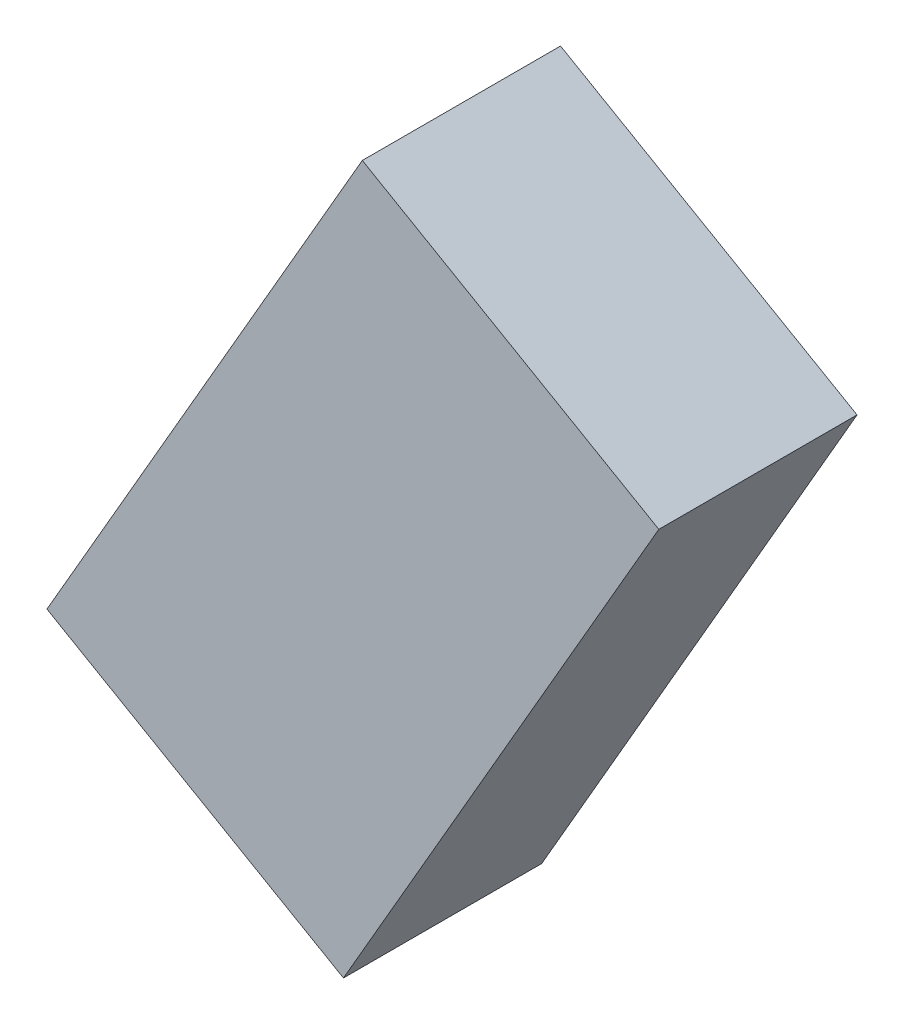
ISO-10303-21;
HEADER;
FILE_DESCRIPTION(('STEP AP214'),'2;1');
FILE_NAME('part.step','',(''),(''),'','','');
FILE_SCHEMA(('AUTOMOTIVE_DESIGN { 1 0 10303 214 1 1 1 1 }'));
ENDSEC;
DATA;
#1=APPLICATION_CONTEXT('core data for automotive mechanical design processes');
#2=APPLICATION_PROTOCOL_DEFINITION('international standard','automotive_design',2000,#1);
#3=PRODUCT_CONTEXT('',#1,'mechanical');
#4=PRODUCT('Part','Part','',(#3));
#5=PRODUCT_RELATED_PRODUCT_CATEGORY('part','',(#4));
#6=PRODUCT_DEFINITION_FORMATION('','',#4);
#7=PRODUCT_DEFINITION_CONTEXT('part definition',#1,'design');
#8=PRODUCT_DEFINITION('design','',#6,#7);
#9=PRODUCT_DEFINITION_SHAPE('','',#8);
#10=(LENGTH_UNIT() NAMED_UNIT(*) SI_UNIT(.MILLI.,.METRE.));
#11=(NAMED_UNIT(*) PLANE_ANGLE_UNIT() SI_UNIT($,.RADIAN.));
#12=(NAMED_UNIT(*) SI_UNIT($,.STERADIAN.) SOLID_ANGLE_UNIT());
#13=UNCERTAINTY_MEASURE_WITH_UNIT(LENGTH_MEASURE(1.E-05),#10,'distance_accuracy_value','');
#14=(GEOMETRIC_REPRESENTATION_CONTEXT(3) GLOBAL_UNCERTAINTY_ASSIGNED_CONTEXT((#13)) GLOBAL_UNIT_ASSIGNED_CONTEXT((#10,
#11,#12)) REPRESENTATION_CONTEXT('',''));
#15=CARTESIAN_POINT('',(0.,0.,0.));
#16=DIRECTION('',(0.,0.,1.));
#17=DIRECTION('',(1.,0.,0.));
#18=AXIS2_PLACEMENT_3D('',#15,#16,#17);
#19=CARTESIAN_POINT('',(-0.0261366,-0.99527106,0.5499989));
#20=DIRECTION('',(0.,0.,-1.));
#21=DIRECTION('',(-1.,0.,0.));
#22=AXIS2_PLACEMENT_3D('',#19,#20,#21);
#23=PLANE('',#22);
#24=DIRECTION('',(0.86602583329618,-0.499999256063104,0.));
#25=VECTOR('',#24,1.);
#26=CARTESIAN_POINT('',(0.84886292,0.52027328,0.5499989));
#27=LINE('',#26,#25);
#28=CARTESIAN_POINT('',(0.848862919999941,0.520273280000034,0.5499989));
#29=VERTEX_POINT('',#28);
#30=CARTESIAN_POINT('',(0.0261365999999478,0.99527359999991,0.5499989));
#31=VERTEX_POINT('',#30);
#32=EDGE_CURVE('E55',#29,#31,#27,.F.);
#33=ORIENTED_EDGE('',*,*,#32,.T.);
#34=DIRECTION('',(0.499998734569058,0.866026134380101,0.));
#35=VECTOR('',#34,1.);
#36=CARTESIAN_POINT('',(0.0261366,0.9952736,0.5499989));
#37=LINE('',#36,#35);
#38=CARTESIAN_POINT('',(-0.848860379999921,-0.520270740000045,0.5499989));
#39=VERTEX_POINT('',#38);
#40=EDGE_CURVE('E57',#31,#39,#37,.F.);
#41=ORIENTED_EDGE('',*,*,#40,.T.);
#42=DIRECTION('',(-0.866025164876141,0.500000413801082,0.));
#43=VECTOR('',#42,1.);
#44=CARTESIAN_POINT('',(-0.84886038,-0.52027074,0.5499989));
#45=LINE('',#44,#43);
#46=CARTESIAN_POINT('',(-0.0261365999999425,-0.995271059999901,0.5499989));
#47=VERTEX_POINT('',#46);
#48=EDGE_CURVE('E20',#39,#47,#45,.F.);
#49=ORIENTED_EDGE('',*,*,#48,.T.);
#50=DIRECTION('',(-0.499999823142186,-0.866025505893321,0.));
#51=VECTOR('',#50,1.);
#52=CARTESIAN_POINT('',(-0.0261366,-0.99527106,0.5499989));
#53=LINE('',#52,#51);
#54=EDGE_CURVE('E80',#47,#29,#53,.F.);
#55=ORIENTED_EDGE('',*,*,#54,.T.);
#56=EDGE_LOOP('',(#33,#41,#49,#55));
#57=FACE_BOUND('',#56,.T.);
#58=ADVANCED_FACE('F17',(#57),#23,.F.);
#59=CARTESIAN_POINT('',(-0.84886038,-0.52027074,0.));
#60=DIRECTION('',(0.500000413801082,0.866025164876141,0.));
#61=DIRECTION('',(-0.866025164876141,0.500000413801082,0.));
#62=AXIS2_PLACEMENT_3D('',#59,#60,#61);
#63=PLANE('',#62);
#64=DIRECTION('',(0.,0.,1.));
#65=VECTOR('',#64,1.);
#66=CARTESIAN_POINT('',(-0.0261366,-0.99527106,0.));
#67=LINE('',#66,#65);
#68=CARTESIAN_POINT('',(-0.0261365999999425,-0.995271059999901,0.));
#69=VERTEX_POINT('',#68);
#70=EDGE_CURVE('E68',#69,#47,#67,.T.);
#71=ORIENTED_EDGE('',*,*,#70,.T.);
#72=ORIENTED_EDGE('',*,*,#48,.F.);
#73=DIRECTION('',(0.,0.,1.));
#74=VECTOR('',#73,1.);
#75=CARTESIAN_POINT('',(-0.848860379999685,-0.520270740000182,0.));
#76=LINE('',#75,#74);
#77=CARTESIAN_POINT('',(-0.848860379999921,-0.520270740000045,0.));
#78=VERTEX_POINT('',#77);
#79=EDGE_CURVE('E63',#39,#78,#76,.F.);
#80=ORIENTED_EDGE('',*,*,#79,.T.);
#81=DIRECTION('',(-0.86602516487602,0.500000413801291,0.));
#82=VECTOR('',#81,1.);
#83=CARTESIAN_POINT('',(-0.0261366,-0.99527106,0.));
#84=LINE('',#83,#82);
#85=EDGE_CURVE('E83',#69,#78,#84,.T.);
#86=ORIENTED_EDGE('',*,*,#85,.F.);
#87=EDGE_LOOP('',(#71,#72,#80,#86));
#88=FACE_BOUND('',#87,.T.);
#89=ADVANCED_FACE('F65',(#88),#63,.F.);
#90=CARTESIAN_POINT('',(0.0261366,0.9952736,0.));
#91=DIRECTION('',(0.866026134380101,-0.499998734569058,0.));
#92=DIRECTION('',(0.499998734569058,0.866026134380101,0.));
#93=AXIS2_PLACEMENT_3D('',#90,#91,#92);
#94=PLANE('',#93);
#95=ORIENTED_EDGE('',*,*,#79,.F.);
#96=ORIENTED_EDGE('',*,*,#40,.F.);
#97=DIRECTION('',(0.,0.,1.));
#98=VECTOR('',#97,1.);
#99=CARTESIAN_POINT('',(0.0261365999997913,0.995273599999639,0.));
#100=LINE('',#99,#98);
#101=CARTESIAN_POINT('',(0.0261365999999478,0.99527359999991,0.));
#102=VERTEX_POINT('',#101);
#103=EDGE_CURVE('E75',#31,#102,#100,.F.);
#104=ORIENTED_EDGE('',*,*,#103,.T.);
#105=DIRECTION('',(0.499998734569238,0.866026134379997,0.));
#106=VECTOR('',#105,1.);
#107=CARTESIAN_POINT('',(-0.84886038,-0.52027074,0.));
#108=LINE('',#107,#106);
#109=EDGE_CURVE('E72',#78,#102,#108,.T.);
#110=ORIENTED_EDGE('',*,*,#109,.F.);
#111=EDGE_LOOP('',(#95,#96,#104,#110));
#112=FACE_BOUND('',#111,.T.);
#113=ADVANCED_FACE('F70',(#112),#94,.F.);
#114=CARTESIAN_POINT('',(0.84886292,0.52027328,0.));
#115=DIRECTION('',(-0.499999256063104,-0.86602583329618,0.));
#116=DIRECTION('',(0.86602583329618,-0.499999256063104,0.));
#117=AXIS2_PLACEMENT_3D('',#114,#115,#116);
#118=PLANE('',#117);
#119=ORIENTED_EDGE('',*,*,#103,.F.);
#120=ORIENTED_EDGE('',*,*,#32,.F.);
#121=DIRECTION('',(0.,0.,1.));
#122=VECTOR('',#121,1.);
#123=CARTESIAN_POINT('',(0.848862919999764,0.520273280000137,0.));
#124=LINE('',#123,#122);
#125=CARTESIAN_POINT('',(0.848862919999941,0.520273280000034,0.));
#126=VERTEX_POINT('',#125);
#127=EDGE_CURVE('E35',#29,#126,#124,.F.);
#128=ORIENTED_EDGE('',*,*,#127,.T.);
#129=DIRECTION('',(0.86602583329596,-0.499999256063484,0.));
#130=VECTOR('',#129,1.);
#131=CARTESIAN_POINT('',(0.0261366,0.9952736,0.));
#132=LINE('',#131,#130);
#133=EDGE_CURVE('E26',#102,#126,#132,.T.);
#134=ORIENTED_EDGE('',*,*,#133,.F.);
#135=EDGE_LOOP('',(#119,#120,#128,#134));
#136=FACE_BOUND('',#135,.T.);
#137=ADVANCED_FACE('F89',(#136),#118,.F.);
#138=CARTESIAN_POINT('',(-0.0261366,-0.99527106,0.));
#139=DIRECTION('',(-0.866025505893321,0.499999823142186,0.));
#140=DIRECTION('',(-0.499999823142186,-0.866025505893321,0.));
#141=AXIS2_PLACEMENT_3D('',#138,#139,#140);
#142=PLANE('',#141);
#143=ORIENTED_EDGE('',*,*,#127,.F.);
#144=ORIENTED_EDGE('',*,*,#54,.F.);
#145=ORIENTED_EDGE('',*,*,#70,.F.);
#146=DIRECTION('',(-0.499999823142321,-0.866025505893243,0.));
#147=VECTOR('',#146,1.);
#148=CARTESIAN_POINT('',(0.84886292,0.52027328,0.));
#149=LINE('',#148,#147);
#150=EDGE_CURVE('E11',#126,#69,#149,.T.);
#151=ORIENTED_EDGE('',*,*,#150,.F.);
#152=EDGE_LOOP('',(#143,#144,#145,#151));
#153=FACE_BOUND('',#152,.T.);
#154=ADVANCED_FACE('F91',(#153),#142,.F.);
#155=CARTESIAN_POINT('',(-0.0261366,-0.99527106,0.));
#156=DIRECTION('',(0.,0.,-1.));
#157=DIRECTION('',(-1.,0.,0.));
#158=AXIS2_PLACEMENT_3D('',#155,#156,#157);
#159=PLANE('',#158);
#160=ORIENTED_EDGE('',*,*,#133,.T.);
#161=ORIENTED_EDGE('',*,*,#150,.T.);
#162=ORIENTED_EDGE('',*,*,#85,.T.);
#163=ORIENTED_EDGE('',*,*,#109,.T.);
#164=EDGE_LOOP('',(#160,#161,#162,#163));
#165=FACE_BOUND('',#164,.T.);
#166=ADVANCED_FACE('F88',(#165),#159,.T.);
#167=CLOSED_SHELL('',(#58,#89,#113,#137,#154,#166));
#168=MANIFOLD_SOLID_BREP('B1',#167);
#169=ADVANCED_BREP_SHAPE_REPRESENTATION('',(#18,#168),#14);
#170=SHAPE_DEFINITION_REPRESENTATION(#9,#169);
ENDSEC;
END-ISO-10303-21;
